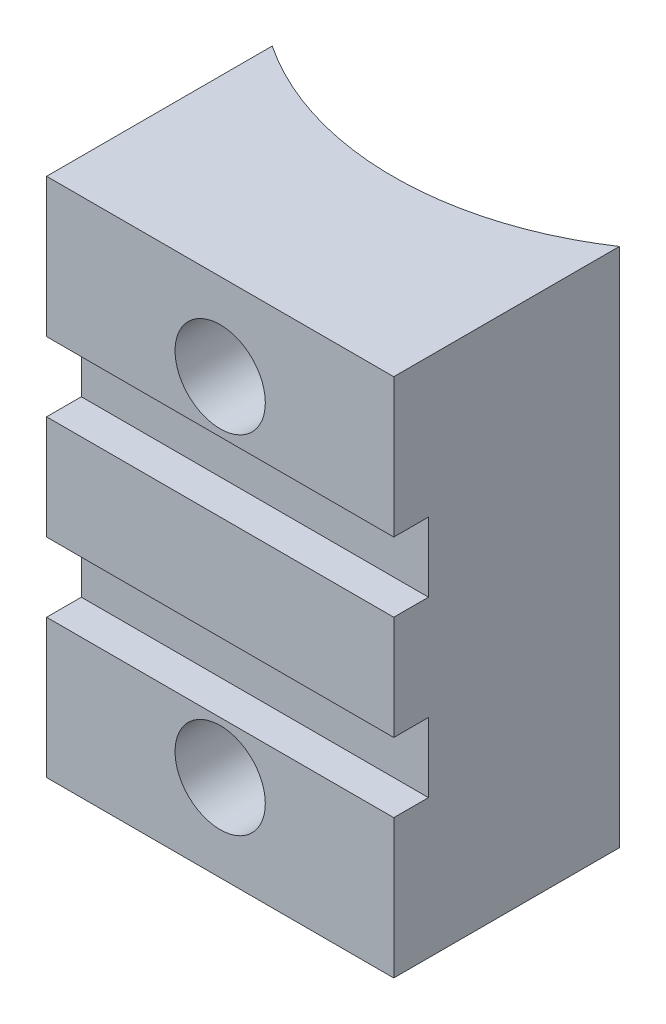
ISO-10303-21;
HEADER;
FILE_DESCRIPTION(('STEP AP214'),'2;1');
FILE_NAME('part.step','',(''),(''),'','','');
FILE_SCHEMA(('AUTOMOTIVE_DESIGN { 1 0 10303 214 1 1 1 1 }'));
ENDSEC;
DATA;
#1=APPLICATION_CONTEXT('core data for automotive mechanical design processes');
#2=APPLICATION_PROTOCOL_DEFINITION('international standard','automotive_design',2000,#1);
#3=PRODUCT_CONTEXT('',#1,'mechanical');
#4=PRODUCT('Part','Part','',(#3));
#5=PRODUCT_RELATED_PRODUCT_CATEGORY('part','',(#4));
#6=PRODUCT_DEFINITION_FORMATION('','',#4);
#7=PRODUCT_DEFINITION_CONTEXT('part definition',#1,'design');
#8=PRODUCT_DEFINITION('design','',#6,#7);
#9=PRODUCT_DEFINITION_SHAPE('','',#8);
#10=(LENGTH_UNIT() NAMED_UNIT(*) SI_UNIT(.MILLI.,.METRE.));
#11=(NAMED_UNIT(*) PLANE_ANGLE_UNIT() SI_UNIT($,.RADIAN.));
#12=(NAMED_UNIT(*) SI_UNIT($,.STERADIAN.) SOLID_ANGLE_UNIT());
#13=UNCERTAINTY_MEASURE_WITH_UNIT(LENGTH_MEASURE(1.E-05),#10,'distance_accuracy_value','');
#14=(GEOMETRIC_REPRESENTATION_CONTEXT(3) GLOBAL_UNCERTAINTY_ASSIGNED_CONTEXT((#13)) GLOBAL_UNIT_ASSIGNED_CONTEXT((#10,
#11,#12)) REPRESENTATION_CONTEXT('',''));
#15=CARTESIAN_POINT('',(0.,0.,0.));
#16=DIRECTION('',(0.,0.,1.));
#17=DIRECTION('',(1.,0.,0.));
#18=AXIS2_PLACEMENT_3D('',#15,#16,#17);
#19=CARTESIAN_POINT('',(0.,30.,0.));
#20=DIRECTION('',(0.,0.,-1.));
#21=DIRECTION('',(-1.,0.,0.));
#22=AXIS2_PLACEMENT_3D('',#19,#20,#21);
#23=PLANE('',#22);
#24=DIRECTION('',(0.,-1.,0.));
#25=VECTOR('',#24,1.);
#26=CARTESIAN_POINT('',(0.,30.,0.));
#27=LINE('',#26,#25);
#28=CARTESIAN_POINT('',(0.,18.,0.));
#29=VERTEX_POINT('',#28);
#30=CARTESIAN_POINT('',(0.,12.,0.));
#31=VERTEX_POINT('',#30);
#32=EDGE_CURVE('E43',#29,#31,#27,.T.);
#33=ORIENTED_EDGE('',*,*,#32,.T.);
#34=DIRECTION('',(1.,0.,0.));
#35=VECTOR('',#34,1.);
#36=CARTESIAN_POINT('',(-0.001000000000001,12.,0.));
#37=LINE('',#36,#35);
#38=CARTESIAN_POINT('',(20.,12.,0.));
#39=VERTEX_POINT('',#38);
#40=EDGE_CURVE('E133',#31,#39,#37,.T.);
#41=ORIENTED_EDGE('',*,*,#40,.T.);
#42=DIRECTION('',(0.,-1.,0.));
#43=VECTOR('',#42,1.);
#44=CARTESIAN_POINT('',(20.,30.,0.));
#45=LINE('',#44,#43);
#46=CARTESIAN_POINT('',(20.,18.,0.));
#47=VERTEX_POINT('',#46);
#48=EDGE_CURVE('E150',#47,#39,#45,.T.);
#49=ORIENTED_EDGE('',*,*,#48,.F.);
#50=DIRECTION('',(1.,0.,0.));
#51=VECTOR('',#50,1.);
#52=CARTESIAN_POINT('',(-0.001000000000001,18.,0.));
#53=LINE('',#52,#51);
#54=EDGE_CURVE('E59',#29,#47,#53,.T.);
#55=ORIENTED_EDGE('',*,*,#54,.F.);
#56=EDGE_LOOP('',(#33,#41,#49,#55));
#57=FACE_BOUND('',#56,.T.);
#58=ADVANCED_FACE('F35',(#57),#23,.F.);
#59=CARTESIAN_POINT('',(10.,25.,0.));
#60=DIRECTION('',(0.,0.,1.));
#61=DIRECTION('',(1.,0.,0.));
#62=AXIS2_PLACEMENT_3D('',#59,#60,#61);
#63=CIRCLE('',#62,2.6);
#64=CARTESIAN_POINT('',(12.6,25.,0.));
#65=VERTEX_POINT('',#64);
#66=EDGE_CURVE('E175',#65,#65,#63,.T.);
#67=ORIENTED_EDGE('',*,*,#66,.F.);
#68=EDGE_LOOP('',(#67));
#69=FACE_BOUND('',#68,.T.);
#70=CARTESIAN_POINT('',(0.,30.,0.));
#71=VERTEX_POINT('',#70);
#72=CARTESIAN_POINT('',(0.,22.,0.));
#73=VERTEX_POINT('',#72);
#74=EDGE_CURVE('E11',#71,#73,#27,.T.);
#75=ORIENTED_EDGE('',*,*,#74,.T.);
#76=DIRECTION('',(1.,0.,0.));
#77=VECTOR('',#76,1.);
#78=CARTESIAN_POINT('',(-0.001000000000001,22.,0.));
#79=LINE('',#78,#77);
#80=CARTESIAN_POINT('',(20.,22.,0.));
#81=VERTEX_POINT('',#80);
#82=EDGE_CURVE('E270',#73,#81,#79,.T.);
#83=ORIENTED_EDGE('',*,*,#82,.T.);
#84=CARTESIAN_POINT('',(20.,30.,0.));
#85=VERTEX_POINT('',#84);
#86=EDGE_CURVE('E147',#85,#81,#45,.T.);
#87=ORIENTED_EDGE('',*,*,#86,.F.);
#88=DIRECTION('',(1.,0.,0.));
#89=VECTOR('',#88,1.);
#90=CARTESIAN_POINT('',(0.,30.,0.));
#91=LINE('',#90,#89);
#92=EDGE_CURVE('E179',#71,#85,#91,.T.);
#93=ORIENTED_EDGE('',*,*,#92,.F.);
#94=EDGE_LOOP('',(#75,#83,#87,#93));
#95=FACE_BOUND('',#94,.T.);
#96=ADVANCED_FACE('F220',(#69,#95),#23,.F.);
#97=CARTESIAN_POINT('',(0.,30.,-13.));
#98=DIRECTION('',(1.,0.,0.));
#99=DIRECTION('',(0.,0.,-1.));
#100=AXIS2_PLACEMENT_3D('',#97,#98,#99);
#101=PLANE('',#100);
#102=DIRECTION('',(0.,-1.,0.));
#103=VECTOR('',#102,1.);
#104=CARTESIAN_POINT('',(0.,12.,-1.99999999999999));
#105=LINE('',#104,#103);
#106=CARTESIAN_POINT('',(0.,12.,-1.99999999999999));
#107=VERTEX_POINT('',#106);
#108=CARTESIAN_POINT('',(0.,8.,-1.99999999999999));
#109=VERTEX_POINT('',#108);
#110=EDGE_CURVE('E336',#107,#109,#105,.T.);
#111=ORIENTED_EDGE('',*,*,#110,.F.);
#112=DIRECTION('',(0.,0.,-1.));
#113=VECTOR('',#112,1.);
#114=CARTESIAN_POINT('',(0.,12.,0.));
#115=LINE('',#114,#113);
#116=EDGE_CURVE('E330',#31,#107,#115,.T.);
#117=ORIENTED_EDGE('',*,*,#116,.F.);
#118=ORIENTED_EDGE('',*,*,#32,.F.);
#119=DIRECTION('',(0.,0.,1.));
#120=VECTOR('',#119,1.);
#121=CARTESIAN_POINT('',(0.,18.,-1.99999999999999));
#122=LINE('',#121,#120);
#123=CARTESIAN_POINT('',(0.,18.,-1.99999999999999));
#124=VERTEX_POINT('',#123);
#125=EDGE_CURVE('E274',#124,#29,#122,.T.);
#126=ORIENTED_EDGE('',*,*,#125,.F.);
#127=DIRECTION('',(0.,-1.,0.));
#128=VECTOR('',#127,1.);
#129=CARTESIAN_POINT('',(0.,22.,-1.99999999999999));
#130=LINE('',#129,#128);
#131=CARTESIAN_POINT('',(0.,22.,-1.99999999999999));
#132=VERTEX_POINT('',#131);
#133=EDGE_CURVE('E132',#132,#124,#130,.T.);
#134=ORIENTED_EDGE('',*,*,#133,.F.);
#135=DIRECTION('',(0.,0.,-1.));
#136=VECTOR('',#135,1.);
#137=CARTESIAN_POINT('',(0.,22.,0.));
#138=LINE('',#137,#136);
#139=EDGE_CURVE('E349',#73,#132,#138,.T.);
#140=ORIENTED_EDGE('',*,*,#139,.F.);
#141=ORIENTED_EDGE('',*,*,#74,.F.);
#142=DIRECTION('',(0.,0.,1.));
#143=VECTOR('',#142,1.);
#144=CARTESIAN_POINT('',(0.,30.,-13.));
#145=LINE('',#144,#143);
#146=CARTESIAN_POINT('',(0.,30.,-13.));
#147=VERTEX_POINT('',#146);
#148=EDGE_CURVE('E169',#147,#71,#145,.T.);
#149=ORIENTED_EDGE('',*,*,#148,.F.);
#150=DIRECTION('',(0.,-1.,0.));
#151=VECTOR('',#150,1.);
#152=CARTESIAN_POINT('',(0.,30.,-13.));
#153=LINE('',#152,#151);
#154=CARTESIAN_POINT('',(0.,0.,-13.));
#155=VERTEX_POINT('',#154);
#156=EDGE_CURVE('E159',#147,#155,#153,.T.);
#157=ORIENTED_EDGE('',*,*,#156,.T.);
#158=DIRECTION('',(0.,0.,1.));
#159=VECTOR('',#158,1.);
#160=CARTESIAN_POINT('',(0.,0.,-13.));
#161=LINE('',#160,#159);
#162=CARTESIAN_POINT('',(0.,0.,0.));
#163=VERTEX_POINT('',#162);
#164=EDGE_CURVE('E146',#155,#163,#161,.T.);
#165=ORIENTED_EDGE('',*,*,#164,.T.);
#166=CARTESIAN_POINT('',(0.,8.,0.));
#167=VERTEX_POINT('',#166);
#168=EDGE_CURVE('E44',#167,#163,#27,.T.);
#169=ORIENTED_EDGE('',*,*,#168,.F.);
#170=DIRECTION('',(0.,0.,1.));
#171=VECTOR('',#170,1.);
#172=CARTESIAN_POINT('',(0.,8.,-1.99999999999999));
#173=LINE('',#172,#171);
#174=EDGE_CURVE('E125',#109,#167,#173,.T.);
#175=ORIENTED_EDGE('',*,*,#174,.F.);
#176=EDGE_LOOP('',(#111,#117,#118,#126,#134,#140,#141,#149,#157,#165,#169,#175));
#177=FACE_BOUND('',#176,.T.);
#178=ADVANCED_FACE('F37',(#177),#101,.F.);
#179=CARTESIAN_POINT('',(10.,5.,0.));
#180=DIRECTION('',(0.,0.,1.));
#181=DIRECTION('',(1.,0.,0.));
#182=AXIS2_PLACEMENT_3D('',#179,#180,#181);
#183=CIRCLE('',#182,2.6);
#184=CARTESIAN_POINT('',(12.6,5.,0.));
#185=VERTEX_POINT('',#184);
#186=EDGE_CURVE('E185',#185,#185,#183,.T.);
#187=ORIENTED_EDGE('',*,*,#186,.F.);
#188=EDGE_LOOP('',(#187));
#189=FACE_BOUND('',#188,.T.);
#190=CARTESIAN_POINT('',(20.,8.,0.));
#191=VERTEX_POINT('',#190);
#192=CARTESIAN_POINT('',(20.,0.,0.));
#193=VERTEX_POINT('',#192);
#194=EDGE_CURVE('E140',#191,#193,#45,.T.);
#195=ORIENTED_EDGE('',*,*,#194,.F.);
#196=DIRECTION('',(1.,0.,0.));
#197=VECTOR('',#196,1.);
#198=CARTESIAN_POINT('',(-0.001000000000001,8.,0.));
#199=LINE('',#198,#197);
#200=EDGE_CURVE('E51',#167,#191,#199,.T.);
#201=ORIENTED_EDGE('',*,*,#200,.F.);
#202=ORIENTED_EDGE('',*,*,#168,.T.);
#203=DIRECTION('',(1.,0.,0.));
#204=VECTOR('',#203,1.);
#205=CARTESIAN_POINT('',(0.,0.,0.));
#206=LINE('',#205,#204);
#207=EDGE_CURVE('E172',#163,#193,#206,.T.);
#208=ORIENTED_EDGE('',*,*,#207,.T.);
#209=EDGE_LOOP('',(#195,#201,#202,#208));
#210=FACE_BOUND('',#209,.T.);
#211=ADVANCED_FACE('F137',(#189,#210),#23,.F.);
#212=CARTESIAN_POINT('',(20.,30.,0.));
#213=DIRECTION('',(-1.,0.,0.));
#214=DIRECTION('',(0.,0.,1.));
#215=AXIS2_PLACEMENT_3D('',#212,#213,#214);
#216=PLANE('',#215);
#217=ORIENTED_EDGE('',*,*,#48,.T.);
#218=DIRECTION('',(0.,0.,1.));
#219=VECTOR('',#218,1.);
#220=CARTESIAN_POINT('',(20.,12.,0.));
#221=LINE('',#220,#219);
#222=CARTESIAN_POINT('',(20.,12.,-2.));
#223=VERTEX_POINT('',#222);
#224=EDGE_CURVE('E141',#223,#39,#221,.T.);
#225=ORIENTED_EDGE('',*,*,#224,.F.);
#226=DIRECTION('',(0.,1.,0.));
#227=VECTOR('',#226,1.);
#228=CARTESIAN_POINT('',(20.,12.,-2.));
#229=LINE('',#228,#227);
#230=CARTESIAN_POINT('',(20.,8.,-2.));
#231=VERTEX_POINT('',#230);
#232=EDGE_CURVE('E341',#231,#223,#229,.T.);
#233=ORIENTED_EDGE('',*,*,#232,.F.);
#234=DIRECTION('',(0.,0.,-1.));
#235=VECTOR('',#234,1.);
#236=CARTESIAN_POINT('',(20.,8.,-2.));
#237=LINE('',#236,#235);
#238=EDGE_CURVE('E335',#191,#231,#237,.T.);
#239=ORIENTED_EDGE('',*,*,#238,.F.);
#240=ORIENTED_EDGE('',*,*,#194,.T.);
#241=DIRECTION('',(0.,0.,-1.));
#242=VECTOR('',#241,1.);
#243=CARTESIAN_POINT('',(20.,0.,0.));
#244=LINE('',#243,#242);
#245=CARTESIAN_POINT('',(20.,0.,-13.));
#246=VERTEX_POINT('',#245);
#247=EDGE_CURVE('E170',#193,#246,#244,.T.);
#248=ORIENTED_EDGE('',*,*,#247,.T.);
#249=DIRECTION('',(0.,-1.,0.));
#250=VECTOR('',#249,1.);
#251=CARTESIAN_POINT('',(20.,30.,-13.));
#252=LINE('',#251,#250);
#253=CARTESIAN_POINT('',(20.,30.,-13.));
#254=VERTEX_POINT('',#253);
#255=EDGE_CURVE('E157',#254,#246,#252,.T.);
#256=ORIENTED_EDGE('',*,*,#255,.F.);
#257=DIRECTION('',(0.,0.,-1.));
#258=VECTOR('',#257,1.);
#259=CARTESIAN_POINT('',(20.,30.,0.));
#260=LINE('',#259,#258);
#261=EDGE_CURVE('E177',#85,#254,#260,.T.);
#262=ORIENTED_EDGE('',*,*,#261,.F.);
#263=ORIENTED_EDGE('',*,*,#86,.T.);
#264=DIRECTION('',(0.,0.,1.));
#265=VECTOR('',#264,1.);
#266=CARTESIAN_POINT('',(20.,22.,0.));
#267=LINE('',#266,#265);
#268=CARTESIAN_POINT('',(20.,22.,-2.));
#269=VERTEX_POINT('',#268);
#270=EDGE_CURVE('E282',#269,#81,#267,.T.);
#271=ORIENTED_EDGE('',*,*,#270,.F.);
#272=DIRECTION('',(0.,1.,0.));
#273=VECTOR('',#272,1.);
#274=CARTESIAN_POINT('',(20.,22.,-2.));
#275=LINE('',#274,#273);
#276=CARTESIAN_POINT('',(20.,18.,-2.));
#277=VERTEX_POINT('',#276);
#278=EDGE_CURVE('E352',#277,#269,#275,.T.);
#279=ORIENTED_EDGE('',*,*,#278,.F.);
#280=DIRECTION('',(0.,0.,-1.));
#281=VECTOR('',#280,1.);
#282=CARTESIAN_POINT('',(20.,18.,-2.));
#283=LINE('',#282,#281);
#284=EDGE_CURVE('E351',#47,#277,#283,.T.);
#285=ORIENTED_EDGE('',*,*,#284,.F.);
#286=EDGE_LOOP('',(#217,#225,#233,#239,#240,#248,#256,#262,#263,#271,#279,#285));
#287=FACE_BOUND('',#286,.T.);
#288=ADVANCED_FACE('F228',(#287),#216,.F.);
#289=CARTESIAN_POINT('',(10.,30.,-27.9666295470958));
#290=DIRECTION('',(0.,-1.,0.));
#291=DIRECTION('',(0.,0.,-1.));
#292=AXIS2_PLACEMENT_3D('',#289,#290,#291);
#293=CYLINDRICAL_SURFACE('',#292,18.);
#294=CARTESIAN_POINT('',(14.4,5.,-10.5126901636786));
#295=CARTESIAN_POINT('',(14.3999927904695,4.75684527932696,-10.5126854280649));
#296=CARTESIAN_POINT('',(14.3797753739596,4.5136095739959,-10.5075535369949));
#297=CARTESIAN_POINT('',(14.2995611696082,4.03411041184602,-10.4876300937382));
#298=CARTESIAN_POINT('',(14.239540194574,3.79785128568015,-10.4728326682357));
#299=CARTESIAN_POINT('',(14.0817671726499,3.3393102985767,-10.4353519245342));
#300=CARTESIAN_POINT('',(13.9840624568589,3.11701130924795,-10.4126785021899));
#301=CARTESIAN_POINT('',(13.753838113163,2.69193932694813,-10.3620127205183));
#302=CARTESIAN_POINT('',(13.6213174085716,2.48916693810339,-10.3340201967049));
#303=CARTESIAN_POINT('',(13.3222446736124,2.10463602756587,-10.2752109348974));
#304=CARTESIAN_POINT('',(13.1550949006456,1.92334896762218,-10.2443507036415));
#305=CARTESIAN_POINT('',(12.7927968671361,1.59108370792538,-10.1836611230879));
#306=CARTESIAN_POINT('',(12.5976460786465,1.44010824767581,-10.1538318671693));
#307=CARTESIAN_POINT('',(12.1816684654367,1.17083479167327,-10.0980853476245));
#308=CARTESIAN_POINT('',(11.9605346435747,1.05299815896861,-10.0722253959843));
#309=CARTESIAN_POINT('',(11.5008611116117,0.856344300842994,-10.0278264811268));
#310=CARTESIAN_POINT('',(11.2623238588998,0.777521578790483,-10.0092864866825));
#311=CARTESIAN_POINT('',(10.7795275042259,0.662638079750616,-9.98192388695742));
#312=CARTESIAN_POINT('',(10.5354692704627,0.625777152315456,-9.97291968890952));
#313=CARTESIAN_POINT('',(10.0444781132026,0.593353811124635,-9.96501108280915));
#314=CARTESIAN_POINT('',(9.79754560171482,0.597785549402987,-9.96610524460263));
#315=CARTESIAN_POINT('',(9.31335860288724,0.647242426076727,-9.97813422349858));
#316=CARTESIAN_POINT('',(9.07600993984433,0.691404119823601,-9.98885971535454));
#317=CARTESIAN_POINT('',(8.61219940859344,0.817681678249037,-10.0187035053585));
#318=CARTESIAN_POINT('',(8.38573810594623,0.899799512271168,-10.0378222389848));
#319=CARTESIAN_POINT('',(7.94783319193007,1.10036892040244,-10.0826276232142));
#320=CARTESIAN_POINT('',(7.73653797020439,1.21913147731592,-10.1083701631574));
#321=CARTESIAN_POINT('',(7.33657117943151,1.48938399924368,-10.1636249800793));
#322=CARTESIAN_POINT('',(7.1479033989431,1.64087943292753,-10.1931378866347));
#323=CARTESIAN_POINT('',(6.79339969256564,1.97693988197787,-10.2536136939332));
#324=CARTESIAN_POINT('',(6.62828161867264,2.16225973364774,-10.2845943521015));
#325=CARTESIAN_POINT('',(6.33131117059573,2.55828325761178,-10.3438114449538));
#326=CARTESIAN_POINT('',(6.19946021430297,2.76898801128072,-10.3720477626386));
#327=CARTESIAN_POINT('',(5.97233414662368,3.2111615494059,-10.422639970093));
#328=CARTESIAN_POINT('',(5.87722482637274,3.44271877026397,-10.4449690649683));
#329=CARTESIAN_POINT('',(5.7275033092137,3.91921179660632,-10.4808706685246));
#330=CARTESIAN_POINT('',(5.67288287615034,4.16414487031583,-10.4944449580147));
#331=CARTESIAN_POINT('',(5.60686597108953,4.65379779162944,-10.5109281413729));
#332=CARTESIAN_POINT('',(5.5944111331054,4.89836632635366,-10.5140981222281));
#333=CARTESIAN_POINT('',(5.61018743303031,5.38608686651012,-10.5101232651286));
#334=CARTESIAN_POINT('',(5.63841500782957,5.62923899412366,-10.502979330503));
#335=CARTESIAN_POINT('',(5.73382858856597,6.10334089381757,-10.4794311104659));
#336=CARTESIAN_POINT('',(5.80040468737145,6.33442129951524,-10.4631719030018));
#337=CARTESIAN_POINT('',(5.96995223460595,6.78214328545249,-10.4233615970585));
#338=CARTESIAN_POINT('',(6.07292784682961,6.99878321045275,-10.3998096643917));
#339=CARTESIAN_POINT('',(6.31458810292838,7.41597691223997,-10.3475134642859));
#340=CARTESIAN_POINT('',(6.45390910795306,7.61615061347613,-10.3186797121222));
#341=CARTESIAN_POINT('',(6.76349554549302,7.99066669854023,-10.2592912293454));
#342=CARTESIAN_POINT('',(6.93376582985062,8.16500502443009,-10.2287362294155));
#343=CARTESIAN_POINT('',(7.30526221418704,8.48715514102861,-10.1684676752269));
#344=CARTESIAN_POINT('',(7.50712869824875,8.63423672062995,-10.1387914633464));
#345=CARTESIAN_POINT('',(7.9333116023739,8.89241029840551,-10.08437920518));
#346=CARTESIAN_POINT('',(8.1576268659287,9.00350414933533,-10.0596429045979));
#347=CARTESIAN_POINT('',(8.62080839000146,9.18560593649583,-10.0180514309384));
#348=CARTESIAN_POINT('',(8.85955802148667,9.25689723717885,-10.0011406973398));
#349=CARTESIAN_POINT('',(9.34611479740752,9.35822841347588,-9.9768630091188));
#350=CARTESIAN_POINT('',(9.59392026699223,9.38827587777441,-9.9694942988202));
#351=CARTESIAN_POINT('',(10.0846816105765,9.40585534498178,-9.96519894593656));
#352=CARTESIAN_POINT('',(10.3275970820783,9.39446719568803,-9.96800707840932));
#353=CARTESIAN_POINT('',(10.8079411123591,9.33196122659036,-9.98316545857042));
#354=CARTESIAN_POINT('',(11.0453698212044,9.28084449471398,-9.99551544496455));
#355=CARTESIAN_POINT('',(11.5069248758807,9.14090075534985,-10.0283327299357));
#356=CARTESIAN_POINT('',(11.7311111355569,9.0522612641304,-10.0487596319024));
#357=CARTESIAN_POINT('',(12.1615546726579,8.83995977370552,-10.0955744584195));
#358=CARTESIAN_POINT('',(12.3678097750382,8.71629353349021,-10.1219631047346));
#359=CARTESIAN_POINT('',(12.7616849025847,8.43411308728381,-10.1786100531563));
#360=CARTESIAN_POINT('',(12.9487655370409,8.27486106199844,-10.2089435557667));
#361=CARTESIAN_POINT('',(13.2939146657553,7.92747268355188,-10.2697115507681));
#362=CARTESIAN_POINT('',(13.45197587303,7.73932909723635,-10.3001460665762));
#363=CARTESIAN_POINT('',(13.737326206699,7.33550629500369,-10.3582785976515));
#364=CARTESIAN_POINT('',(13.8640238339383,7.11940018507625,-10.3859189236027));
#365=CARTESIAN_POINT('',(14.079100345674,6.66831395238421,-10.434567877233));
#366=CARTESIAN_POINT('',(14.1675079837265,6.4333481498746,-10.4555814779622));
#367=CARTESIAN_POINT('',(14.2898348195082,5.99888577128393,-10.4851989496193));
#368=CARTESIAN_POINT('',(14.3310588233462,5.80152518385488,-10.495432355718));
#369=CARTESIAN_POINT('',(14.3861433415431,5.40279471445145,-10.5091796643481));
#370=CARTESIAN_POINT('',(14.4000059722498,5.20142514378102,-10.5126940865787));
#371=CARTESIAN_POINT('',(14.4,5.,-10.5126901636786));
#372=B_SPLINE_CURVE_WITH_KNOTS('',3,(#294,#295,#296,#297,#298,#299,#300,#301,#302,#303,#304,
#305,#306,#307,#308,#309,#310,#311,#312,#313,#314,#315,#316,#317,#318,#319,#320,#321,#322,#323,
#324,#325,#326,#327,#328,#329,#330,#331,#332,#333,#334,#335,#336,#337,#338,#339,#340,#341,#342,
#343,#344,#345,#346,#347,#348,#349,#350,#351,#352,#353,#354,#355,#356,#357,#358,#359,#360,#361,
#362,#363,#364,#365,#366,#367,#368,#369,#370,#371),.UNSPECIFIED.,.T.,.F.,(4,2,2,2,2,2,2,2,2,2,2,
2,2,2,2,2,2,2,2,2,2,2,2,2,2,2,2,2,2,2,2,2,2,2,2,2,2,2,4),(0.,0.728724760106152,1.45789274632998,
2.18614785823771,2.91442549412954,3.6565149753903,4.39867149509653,5.15069964149,
5.90262180519587,6.63995223908943,7.37717825207246,8.0987592961553,8.82037778346923,
9.54829698628969,10.2763378964671,11.0232338766863,11.7701616852825,12.5204215860936,
13.2705288288689,14.0016627751062,14.7327326899344,15.4524844232005,16.1723185165998,
16.9057177611738,17.6392320782585,18.3902067187869,19.1411426907543,19.886662070421,
20.6320442594047,21.3581419137968,22.0842196854305,22.8067110114502,23.5292898535469,
24.2685310267714,25.0079575755553,25.760417351364,26.512311089749,27.1160207109682,
27.7196836346198),.UNSPECIFIED.);
#373=CARTESIAN_POINT('',(14.4,5.,-10.5126901636786));
#374=VERTEX_POINT('',#373);
#375=EDGE_CURVE('E262',#374,#374,#372,.T.);
#376=ORIENTED_EDGE('',*,*,#375,.F.);
#377=EDGE_LOOP('',(#376));
#378=FACE_BOUND('',#377,.T.);
#379=CARTESIAN_POINT('',(14.4,25.,-10.5126901636786));
#380=CARTESIAN_POINT('',(14.3999927904695,24.756845279327,-10.5126854280649));
#381=CARTESIAN_POINT('',(14.3797753739596,24.5136095739959,-10.5075535369949));
#382=CARTESIAN_POINT('',(14.2995611696082,24.034110411846,-10.4876300937382));
#383=CARTESIAN_POINT('',(14.239540194574,23.7978512856802,-10.4728326682357));
#384=CARTESIAN_POINT('',(14.0817671726499,23.3393102985767,-10.4353519245342));
#385=CARTESIAN_POINT('',(13.9840624568589,23.1170113092479,-10.4126785021899));
#386=CARTESIAN_POINT('',(13.753838113163,22.6919393269481,-10.3620127205183));
#387=CARTESIAN_POINT('',(13.6213174085716,22.4891669381034,-10.3340201967049));
#388=CARTESIAN_POINT('',(13.3222446736124,22.1046360275659,-10.2752109348974));
#389=CARTESIAN_POINT('',(13.1550949006456,21.9233489676222,-10.2443507036415));
#390=CARTESIAN_POINT('',(12.7927968671361,21.5910837079254,-10.1836611230879));
#391=CARTESIAN_POINT('',(12.5976460786465,21.4401082476758,-10.1538318671693));
#392=CARTESIAN_POINT('',(12.1816684654367,21.1708347916733,-10.0980853476245));
#393=CARTESIAN_POINT('',(11.9605346435747,21.0529981589686,-10.0722253959843));
#394=CARTESIAN_POINT('',(11.5008611116117,20.856344300843,-10.0278264811268));
#395=CARTESIAN_POINT('',(11.2623238588998,20.7775215787905,-10.0092864866825));
#396=CARTESIAN_POINT('',(10.7795275042259,20.6626380797506,-9.98192388695742));
#397=CARTESIAN_POINT('',(10.5354692704627,20.6257771523155,-9.97291968890952));
#398=CARTESIAN_POINT('',(10.0444781132025,20.5933538111246,-9.96501108280915));
#399=CARTESIAN_POINT('',(9.79754560171482,20.597785549403,-9.96610524460263));
#400=CARTESIAN_POINT('',(9.31335860288725,20.6472424260767,-9.97813422349858));
#401=CARTESIAN_POINT('',(9.07600993984433,20.6914041198236,-9.98885971535454));
#402=CARTESIAN_POINT('',(8.61219940859344,20.817681678249,-10.0187035053585));
#403=CARTESIAN_POINT('',(8.38573810594623,20.8997995122712,-10.0378222389848));
#404=CARTESIAN_POINT('',(7.94783319193007,21.1003689204024,-10.0826276232142));
#405=CARTESIAN_POINT('',(7.73653797020439,21.2191314773159,-10.1083701631574));
#406=CARTESIAN_POINT('',(7.33657117943151,21.4893839992437,-10.1636249800793));
#407=CARTESIAN_POINT('',(7.14790339894309,21.6408794329275,-10.1931378866347));
#408=CARTESIAN_POINT('',(6.79339969256564,21.9769398819779,-10.2536136939332));
#409=CARTESIAN_POINT('',(6.62828161867263,22.1622597336477,-10.2845943521015));
#410=CARTESIAN_POINT('',(6.33131117059573,22.5582832576118,-10.3438114449538));
#411=CARTESIAN_POINT('',(6.19946021430296,22.7689880112807,-10.3720477626386));
#412=CARTESIAN_POINT('',(5.97233414662368,23.2111615494059,-10.422639970093));
#413=CARTESIAN_POINT('',(5.87722482637273,23.442718770264,-10.4449690649683));
#414=CARTESIAN_POINT('',(5.72750330921369,23.9192117966063,-10.4808706685246));
#415=CARTESIAN_POINT('',(5.67288287615034,24.1641448703158,-10.4944449580147));
#416=CARTESIAN_POINT('',(5.60686597108953,24.6537977916294,-10.5109281413729));
#417=CARTESIAN_POINT('',(5.59441113310539,24.8983663263537,-10.5140981222281));
#418=CARTESIAN_POINT('',(5.6101874330303,25.3860868665101,-10.5101232651286));
#419=CARTESIAN_POINT('',(5.63841500782957,25.6292389941237,-10.502979330503));
#420=CARTESIAN_POINT('',(5.73382858856597,26.1033408938176,-10.4794311104659));
#421=CARTESIAN_POINT('',(5.80040468737144,26.3344212995152,-10.4631719030018));
#422=CARTESIAN_POINT('',(5.96995223460595,26.7821432854525,-10.4233615970585));
#423=CARTESIAN_POINT('',(6.07292784682961,26.9987832104527,-10.3998096643917));
#424=CARTESIAN_POINT('',(6.31458810292837,27.41597691224,-10.3475134642859));
#425=CARTESIAN_POINT('',(6.45390910795305,27.6161506134761,-10.3186797121222));
#426=CARTESIAN_POINT('',(6.76349554549302,27.9906666985402,-10.2592912293454));
#427=CARTESIAN_POINT('',(6.93376582985062,28.1650050244301,-10.2287362294156));
#428=CARTESIAN_POINT('',(7.30526221418704,28.4871551410286,-10.1684676752269));
#429=CARTESIAN_POINT('',(7.50712869824875,28.63423672063,-10.1387914633464));
#430=CARTESIAN_POINT('',(7.9333116023739,28.8924102984055,-10.08437920518));
#431=CARTESIAN_POINT('',(8.1576268659287,29.0035041493353,-10.0596429045979));
#432=CARTESIAN_POINT('',(8.62080839000146,29.1856059364958,-10.0180514309384));
#433=CARTESIAN_POINT('',(8.85955802148667,29.2568972371789,-10.0011406973398));
#434=CARTESIAN_POINT('',(9.34611479740752,29.3582284134759,-9.9768630091188));
#435=CARTESIAN_POINT('',(9.59392026699223,29.3882758777744,-9.9694942988202));
#436=CARTESIAN_POINT('',(10.0846816105765,29.4058553449818,-9.96519894593656));
#437=CARTESIAN_POINT('',(10.3275970820783,29.394467195688,-9.96800707840932));
#438=CARTESIAN_POINT('',(10.8079411123591,29.3319612265904,-9.98316545857041));
#439=CARTESIAN_POINT('',(11.0453698212044,29.280844494714,-9.99551544496455));
#440=CARTESIAN_POINT('',(11.5069248758807,29.1409007553499,-10.0283327299357));
#441=CARTESIAN_POINT('',(11.7311111355569,29.0522612641304,-10.0487596319024));
#442=CARTESIAN_POINT('',(12.1615546726579,28.8399597737055,-10.0955744584195));
#443=CARTESIAN_POINT('',(12.3678097750382,28.7162935334902,-10.1219631047346));
#444=CARTESIAN_POINT('',(12.7616849025847,28.4341130872838,-10.1786100531563));
#445=CARTESIAN_POINT('',(12.9487655370409,28.2748610619984,-10.2089435557667));
#446=CARTESIAN_POINT('',(13.2939146657553,27.9274726835519,-10.2697115507681));
#447=CARTESIAN_POINT('',(13.45197587303,27.7393290972364,-10.3001460665762));
#448=CARTESIAN_POINT('',(13.737326206699,27.3355062950037,-10.3582785976515));
#449=CARTESIAN_POINT('',(13.8640238339383,27.1194001850763,-10.3859189236027));
#450=CARTESIAN_POINT('',(14.079100345674,26.6683139523842,-10.434567877233));
#451=CARTESIAN_POINT('',(14.1675079837265,26.4333481498746,-10.4555814779622));
#452=CARTESIAN_POINT('',(14.2898348195082,25.9988857712839,-10.4851989496193));
#453=CARTESIAN_POINT('',(14.3310588233462,25.8015251838549,-10.495432355718));
#454=CARTESIAN_POINT('',(14.3861433415431,25.4027947144515,-10.5091796643481));
#455=CARTESIAN_POINT('',(14.4000059722498,25.201425143781,-10.5126940865787));
#456=CARTESIAN_POINT('',(14.4,25.,-10.5126901636786));
#457=B_SPLINE_CURVE_WITH_KNOTS('',3,(#379,#380,#381,#382,#383,#384,#385,#386,#387,#388,#389,
#390,#391,#392,#393,#394,#395,#396,#397,#398,#399,#400,#401,#402,#403,#404,#405,#406,#407,#408,
#409,#410,#411,#412,#413,#414,#415,#416,#417,#418,#419,#420,#421,#422,#423,#424,#425,#426,#427,
#428,#429,#430,#431,#432,#433,#434,#435,#436,#437,#438,#439,#440,#441,#442,#443,#444,#445,#446,
#447,#448,#449,#450,#451,#452,#453,#454,#455,#456),.UNSPECIFIED.,.T.,.F.,(4,2,2,2,2,2,2,2,2,2,2,
2,2,2,2,2,2,2,2,2,2,2,2,2,2,2,2,2,2,2,2,2,2,2,2,2,2,2,4),(0.,0.728724760106152,1.45789274632998,
2.18614785823771,2.91442549412954,3.6565149753903,4.39867149509652,5.15069964149,
5.90262180519587,6.63995223908943,7.37717825207246,8.0987592961553,8.82037778346924,
9.5482969862897,10.2763378964671,11.0232338766863,11.7701616852825,12.5204215860936,
13.2705288288689,14.0016627751062,14.7327326899345,15.4524844232005,16.1723185165998,
16.9057177611739,17.6392320782585,18.3902067187869,19.1411426907543,19.886662070421,
20.6320442594047,21.3581419137968,22.0842196854305,22.8067110114502,23.5292898535469,
24.2685310267714,25.0079575755553,25.760417351364,26.512311089749,27.1160207109682,
27.7196836346198),.UNSPECIFIED.);
#458=CARTESIAN_POINT('',(14.4,25.,-10.5126901636786));
#459=VERTEX_POINT('',#458);
#460=EDGE_CURVE('E188',#459,#459,#457,.T.);
#461=ORIENTED_EDGE('',*,*,#460,.F.);
#462=EDGE_LOOP('',(#461));
#463=FACE_BOUND('',#462,.T.);
#464=CARTESIAN_POINT('',(10.,0.,-27.9666295470958));
#465=DIRECTION('',(0.,-1.,0.));
#466=DIRECTION('',(0.,0.,-1.));
#467=AXIS2_PLACEMENT_3D('',#464,#465,#466);
#468=CIRCLE('',#467,18.);
#469=EDGE_CURVE('E167',#246,#155,#468,.T.);
#470=ORIENTED_EDGE('',*,*,#469,.T.);
#471=ORIENTED_EDGE('',*,*,#156,.F.);
#472=CARTESIAN_POINT('',(10.,30.,-27.9666295470958));
#473=DIRECTION('',(0.,-1.,0.));
#474=DIRECTION('',(0.,0.,-1.));
#475=AXIS2_PLACEMENT_3D('',#472,#473,#474);
#476=CIRCLE('',#475,18.);
#477=EDGE_CURVE('E164',#254,#147,#476,.T.);
#478=ORIENTED_EDGE('',*,*,#477,.F.);
#479=ORIENTED_EDGE('',*,*,#255,.T.);
#480=EDGE_LOOP('',(#470,#471,#478,#479));
#481=FACE_BOUND('',#480,.T.);
#482=ADVANCED_FACE('F234',(#378,#463,#481),#293,.F.);
#483=CARTESIAN_POINT('',(10.,30.,-27.9666295470958));
#484=DIRECTION('',(0.,-1.,0.));
#485=DIRECTION('',(0.,0.,-1.));
#486=AXIS2_PLACEMENT_3D('',#483,#484,#485);
#487=PLANE('',#486);
#488=ORIENTED_EDGE('',*,*,#148,.T.);
#489=ORIENTED_EDGE('',*,*,#92,.T.);
#490=ORIENTED_EDGE('',*,*,#261,.T.);
#491=ORIENTED_EDGE('',*,*,#477,.T.);
#492=EDGE_LOOP('',(#488,#489,#490,#491));
#493=FACE_BOUND('',#492,.T.);
#494=ADVANCED_FACE('F248',(#493),#487,.F.);
#495=CARTESIAN_POINT('',(10.,0.,-27.9666295470958));
#496=DIRECTION('',(0.,-1.,0.));
#497=DIRECTION('',(0.,0.,-1.));
#498=AXIS2_PLACEMENT_3D('',#495,#496,#497);
#499=PLANE('',#498);
#500=ORIENTED_EDGE('',*,*,#164,.F.);
#501=ORIENTED_EDGE('',*,*,#469,.F.);
#502=ORIENTED_EDGE('',*,*,#247,.F.);
#503=ORIENTED_EDGE('',*,*,#207,.F.);
#504=EDGE_LOOP('',(#500,#501,#502,#503));
#505=FACE_BOUND('',#504,.T.);
#506=ADVANCED_FACE('F243',(#505),#499,.T.);
#507=CARTESIAN_POINT('',(10.,25.,-13.001));
#508=DIRECTION('',(0.,0.,1.));
#509=DIRECTION('',(1.,0.,0.));
#510=AXIS2_PLACEMENT_3D('',#507,#508,#509);
#511=CYLINDRICAL_SURFACE('',#510,2.6);
#512=CARTESIAN_POINT('',(10.,25.,-4.5));
#513=DIRECTION('',(0.,0.,1.));
#514=DIRECTION('',(1.,0.,0.));
#515=AXIS2_PLACEMENT_3D('',#512,#513,#514);
#516=CIRCLE('',#515,2.6);
#517=CARTESIAN_POINT('',(12.6,25.,-4.5));
#518=VERTEX_POINT('',#517);
#519=EDGE_CURVE('E195',#518,#518,#516,.T.);
#520=ORIENTED_EDGE('',*,*,#519,.F.);
#521=EDGE_LOOP('',(#520));
#522=FACE_BOUND('',#521,.T.);
#523=ORIENTED_EDGE('',*,*,#66,.T.);
#524=EDGE_LOOP('',(#523));
#525=FACE_BOUND('',#524,.T.);
#526=ADVANCED_FACE('F238',(#522,#525),#511,.F.);
#527=CARTESIAN_POINT('',(10.,5.,-13.001));
#528=DIRECTION('',(0.,0.,1.));
#529=DIRECTION('',(1.,0.,0.));
#530=AXIS2_PLACEMENT_3D('',#527,#528,#529);
#531=CYLINDRICAL_SURFACE('',#530,2.6);
#532=CARTESIAN_POINT('',(10.,5.,-4.5));
#533=DIRECTION('',(0.,0.,1.));
#534=DIRECTION('',(1.,0.,0.));
#535=AXIS2_PLACEMENT_3D('',#532,#533,#534);
#536=CIRCLE('',#535,2.6);
#537=CARTESIAN_POINT('',(12.6,5.,-4.5));
#538=VERTEX_POINT('',#537);
#539=EDGE_CURVE('E289',#538,#538,#536,.T.);
#540=ORIENTED_EDGE('',*,*,#539,.F.);
#541=EDGE_LOOP('',(#540));
#542=FACE_BOUND('',#541,.T.);
#543=ORIENTED_EDGE('',*,*,#186,.T.);
#544=EDGE_LOOP('',(#543));
#545=FACE_BOUND('',#544,.T.);
#546=ADVANCED_FACE('F215',(#542,#545),#531,.F.);
#547=CARTESIAN_POINT('',(10.,25.,-13.001));
#548=DIRECTION('',(0.,0.,1.));
#549=DIRECTION('',(1.,0.,0.));
#550=AXIS2_PLACEMENT_3D('',#547,#548,#549);
#551=CYLINDRICAL_SURFACE('',#550,4.4);
#552=CARTESIAN_POINT('',(10.,25.,-4.5));
#553=DIRECTION('',(0.,0.,1.));
#554=DIRECTION('',(1.,0.,0.));
#555=AXIS2_PLACEMENT_3D('',#552,#553,#554);
#556=CIRCLE('',#555,4.4);
#557=CARTESIAN_POINT('',(14.4,25.,-4.5));
#558=VERTEX_POINT('',#557);
#559=EDGE_CURVE('E295',#558,#558,#556,.T.);
#560=ORIENTED_EDGE('',*,*,#559,.T.);
#561=EDGE_LOOP('',(#560));
#562=FACE_BOUND('',#561,.T.);
#563=ORIENTED_EDGE('',*,*,#460,.T.);
#564=EDGE_LOOP('',(#563));
#565=FACE_BOUND('',#564,.T.);
#566=ADVANCED_FACE('F197',(#562,#565),#551,.F.);
#567=CARTESIAN_POINT('',(10.,25.,-4.5));
#568=DIRECTION('',(0.,0.,1.));
#569=DIRECTION('',(1.,0.,0.));
#570=AXIS2_PLACEMENT_3D('',#567,#568,#569);
#571=PLANE('',#570);
#572=ORIENTED_EDGE('',*,*,#559,.F.);
#573=EDGE_LOOP('',(#572));
#574=FACE_BOUND('',#573,.T.);
#575=ORIENTED_EDGE('',*,*,#519,.T.);
#576=EDGE_LOOP('',(#575));
#577=FACE_BOUND('',#576,.T.);
#578=ADVANCED_FACE('F206',(#574,#577),#571,.F.);
#579=CARTESIAN_POINT('',(10.,5.,-13.001));
#580=DIRECTION('',(0.,0.,1.));
#581=DIRECTION('',(1.,0.,0.));
#582=AXIS2_PLACEMENT_3D('',#579,#580,#581);
#583=CYLINDRICAL_SURFACE('',#582,4.4);
#584=CARTESIAN_POINT('',(10.,5.,-4.5));
#585=DIRECTION('',(0.,0.,1.));
#586=DIRECTION('',(1.,0.,0.));
#587=AXIS2_PLACEMENT_3D('',#584,#585,#586);
#588=CIRCLE('',#587,4.4);
#589=CARTESIAN_POINT('',(14.4,5.,-4.5));
#590=VERTEX_POINT('',#589);
#591=EDGE_CURVE('E277',#590,#590,#588,.T.);
#592=ORIENTED_EDGE('',*,*,#591,.T.);
#593=EDGE_LOOP('',(#592));
#594=FACE_BOUND('',#593,.T.);
#595=ORIENTED_EDGE('',*,*,#375,.T.);
#596=EDGE_LOOP('',(#595));
#597=FACE_BOUND('',#596,.T.);
#598=ADVANCED_FACE('F203',(#594,#597),#583,.F.);
#599=CARTESIAN_POINT('',(10.,5.,-4.5));
#600=DIRECTION('',(0.,0.,1.));
#601=DIRECTION('',(1.,0.,0.));
#602=AXIS2_PLACEMENT_3D('',#599,#600,#601);
#603=PLANE('',#602);
#604=ORIENTED_EDGE('',*,*,#591,.F.);
#605=EDGE_LOOP('',(#604));
#606=FACE_BOUND('',#605,.T.);
#607=ORIENTED_EDGE('',*,*,#539,.T.);
#608=EDGE_LOOP('',(#607));
#609=FACE_BOUND('',#608,.T.);
#610=ADVANCED_FACE('F213',(#606,#609),#603,.F.);
#611=CARTESIAN_POINT('',(-0.001000000000001,22.,0.));
#612=DIRECTION('',(0.,1.,0.));
#613=DIRECTION('',(0.,0.,1.));
#614=AXIS2_PLACEMENT_3D('',#611,#612,#613);
#615=PLANE('',#614);
#616=ORIENTED_EDGE('',*,*,#139,.T.);
#617=DIRECTION('',(1.,0.,0.));
#618=VECTOR('',#617,1.);
#619=CARTESIAN_POINT('',(-0.001000000000001,22.,-1.99999999999999));
#620=LINE('',#619,#618);
#621=EDGE_CURVE('E275',#132,#269,#620,.T.);
#622=ORIENTED_EDGE('',*,*,#621,.T.);
#623=ORIENTED_EDGE('',*,*,#270,.T.);
#624=ORIENTED_EDGE('',*,*,#82,.F.);
#625=EDGE_LOOP('',(#616,#622,#623,#624));
#626=FACE_BOUND('',#625,.T.);
#627=ADVANCED_FACE('F301',(#626),#615,.F.);
#628=CARTESIAN_POINT('',(-0.001000000000001,22.,-1.99999999999999));
#629=DIRECTION('',(0.,0.,-1.));
#630=DIRECTION('',(-1.,0.,0.));
#631=AXIS2_PLACEMENT_3D('',#628,#629,#630);
#632=PLANE('',#631);
#633=ORIENTED_EDGE('',*,*,#133,.T.);
#634=DIRECTION('',(1.,0.,0.));
#635=VECTOR('',#634,1.);
#636=CARTESIAN_POINT('',(-0.001000000000001,18.,-1.99999999999999));
#637=LINE('',#636,#635);
#638=EDGE_CURVE('E279',#124,#277,#637,.T.);
#639=ORIENTED_EDGE('',*,*,#638,.T.);
#640=ORIENTED_EDGE('',*,*,#278,.T.);
#641=ORIENTED_EDGE('',*,*,#621,.F.);
#642=EDGE_LOOP('',(#633,#639,#640,#641));
#643=FACE_BOUND('',#642,.T.);
#644=ADVANCED_FACE('F306',(#643),#632,.F.);
#645=CARTESIAN_POINT('',(-0.001000000000001,18.,-1.99999999999999));
#646=DIRECTION('',(0.,-1.,0.));
#647=DIRECTION('',(0.,0.,-1.));
#648=AXIS2_PLACEMENT_3D('',#645,#646,#647);
#649=PLANE('',#648);
#650=ORIENTED_EDGE('',*,*,#125,.T.);
#651=ORIENTED_EDGE('',*,*,#54,.T.);
#652=ORIENTED_EDGE('',*,*,#284,.T.);
#653=ORIENTED_EDGE('',*,*,#638,.F.);
#654=EDGE_LOOP('',(#650,#651,#652,#653));
#655=FACE_BOUND('',#654,.T.);
#656=ADVANCED_FACE('F298',(#655),#649,.F.);
#657=CARTESIAN_POINT('',(-0.001000000000001,12.,0.));
#658=DIRECTION('',(0.,1.,0.));
#659=DIRECTION('',(0.,0.,1.));
#660=AXIS2_PLACEMENT_3D('',#657,#658,#659);
#661=PLANE('',#660);
#662=ORIENTED_EDGE('',*,*,#116,.T.);
#663=DIRECTION('',(1.,0.,0.));
#664=VECTOR('',#663,1.);
#665=CARTESIAN_POINT('',(-0.001000000000001,12.,-1.99999999999999));
#666=LINE('',#665,#664);
#667=EDGE_CURVE('E331',#107,#223,#666,.T.);
#668=ORIENTED_EDGE('',*,*,#667,.T.);
#669=ORIENTED_EDGE('',*,*,#224,.T.);
#670=ORIENTED_EDGE('',*,*,#40,.F.);
#671=EDGE_LOOP('',(#662,#668,#669,#670));
#672=FACE_BOUND('',#671,.T.);
#673=ADVANCED_FACE('F321',(#672),#661,.F.);
#674=CARTESIAN_POINT('',(-0.001000000000001,12.,-1.99999999999999));
#675=DIRECTION('',(0.,0.,-1.));
#676=DIRECTION('',(-1.,0.,0.));
#677=AXIS2_PLACEMENT_3D('',#674,#675,#676);
#678=PLANE('',#677);
#679=ORIENTED_EDGE('',*,*,#110,.T.);
#680=DIRECTION('',(1.,0.,0.));
#681=VECTOR('',#680,1.);
#682=CARTESIAN_POINT('',(-0.001000000000001,8.,-1.99999999999999));
#683=LINE('',#682,#681);
#684=EDGE_CURVE('E127',#109,#231,#683,.T.);
#685=ORIENTED_EDGE('',*,*,#684,.T.);
#686=ORIENTED_EDGE('',*,*,#232,.T.);
#687=ORIENTED_EDGE('',*,*,#667,.F.);
#688=EDGE_LOOP('',(#679,#685,#686,#687));
#689=FACE_BOUND('',#688,.T.);
#690=ADVANCED_FACE('F318',(#689),#678,.F.);
#691=CARTESIAN_POINT('',(-0.001000000000001,8.,-1.99999999999999));
#692=DIRECTION('',(0.,-1.,0.));
#693=DIRECTION('',(0.,0.,-1.));
#694=AXIS2_PLACEMENT_3D('',#691,#692,#693);
#695=PLANE('',#694);
#696=ORIENTED_EDGE('',*,*,#174,.T.);
#697=ORIENTED_EDGE('',*,*,#200,.T.);
#698=ORIENTED_EDGE('',*,*,#238,.T.);
#699=ORIENTED_EDGE('',*,*,#684,.F.);
#700=EDGE_LOOP('',(#696,#697,#698,#699));
#701=FACE_BOUND('',#700,.T.);
#702=ADVANCED_FACE('F126',(#701),#695,.F.);
#703=CLOSED_SHELL('',(#58,#96,#178,#211,#288,#482,#494,#506,#526,#546,#566,#578,#598,#610,#627,
#644,#656,#673,#690,#702));
#704=MANIFOLD_SOLID_BREP('B2',#703);
#705=ADVANCED_BREP_SHAPE_REPRESENTATION('',(#18,#704),#14);
#706=SHAPE_DEFINITION_REPRESENTATION(#9,#705);
ENDSEC;
END-ISO-10303-21;
